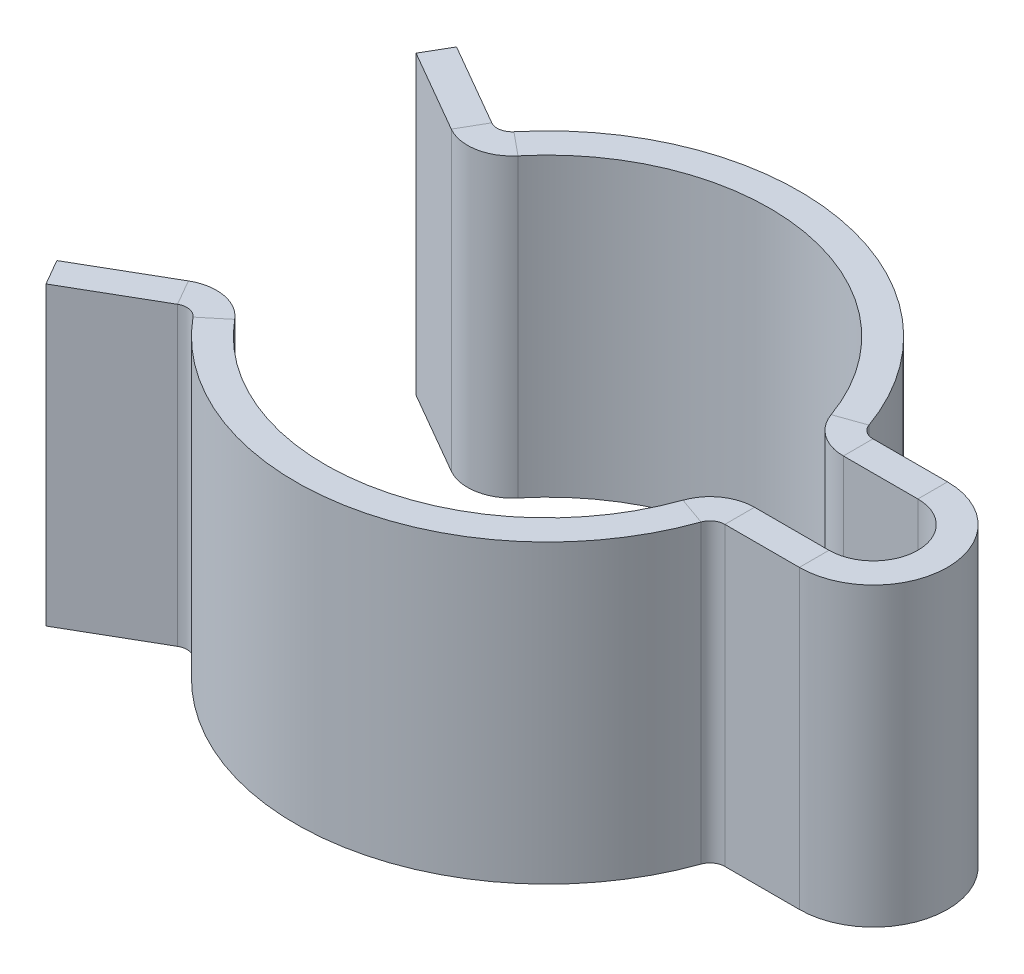
ISO-10303-21;
HEADER;
FILE_DESCRIPTION(('STEP AP214'),'2;1');
FILE_NAME('part.step','',(''),(''),'','','');
FILE_SCHEMA(('AUTOMOTIVE_DESIGN { 1 0 10303 214 1 1 1 1 }'));
ENDSEC;
DATA;
#1=APPLICATION_CONTEXT('core data for automotive mechanical design processes');
#2=APPLICATION_PROTOCOL_DEFINITION('international standard','automotive_design',2000,#1);
#3=PRODUCT_CONTEXT('',#1,'mechanical');
#4=PRODUCT('Part','Part','',(#3));
#5=PRODUCT_RELATED_PRODUCT_CATEGORY('part','',(#4));
#6=PRODUCT_DEFINITION_FORMATION('','',#4);
#7=PRODUCT_DEFINITION_CONTEXT('part definition',#1,'design');
#8=PRODUCT_DEFINITION('design','',#6,#7);
#9=PRODUCT_DEFINITION_SHAPE('','',#8);
#10=(LENGTH_UNIT() NAMED_UNIT(*) SI_UNIT(.MILLI.,.METRE.));
#11=(NAMED_UNIT(*) PLANE_ANGLE_UNIT() SI_UNIT($,.RADIAN.));
#12=(NAMED_UNIT(*) SI_UNIT($,.STERADIAN.) SOLID_ANGLE_UNIT());
#13=UNCERTAINTY_MEASURE_WITH_UNIT(LENGTH_MEASURE(1.E-05),#10,'distance_accuracy_value','');
#14=(GEOMETRIC_REPRESENTATION_CONTEXT(3) GLOBAL_UNCERTAINTY_ASSIGNED_CONTEXT((#13)) GLOBAL_UNIT_ASSIGNED_CONTEXT((#10,
#11,#12)) REPRESENTATION_CONTEXT('',''));
#15=CARTESIAN_POINT('',(0.,0.,0.));
#16=DIRECTION('',(0.,0.,1.));
#17=DIRECTION('',(1.,0.,0.));
#18=AXIS2_PLACEMENT_3D('',#15,#16,#17);
#19=CARTESIAN_POINT('',(1.1,1.,-0.15));
#20=DIRECTION('',(0.,1.,0.));
#21=DIRECTION('',(0.,0.,1.));
#22=AXIS2_PLACEMENT_3D('',#19,#20,#21);
#23=PLANE('',#22);
#24=DIRECTION('',(0.,0.,-1.));
#25=VECTOR('',#24,1.);
#26=CARTESIAN_POINT('',(1.1,1.,-0.15));
#27=LINE('',#26,#25);
#28=CARTESIAN_POINT('',(1.1,1.,-0.15));
#29=VERTEX_POINT('',#28);
#30=CARTESIAN_POINT('',(1.1,1.,-0.25));
#31=VERTEX_POINT('',#30);
#32=EDGE_CURVE('E13',#29,#31,#27,.T.);
#33=ORIENTED_EDGE('',*,*,#32,.F.);
#34=CARTESIAN_POINT('',(1.1,1.,0.));
#35=DIRECTION('',(0.,1.,0.));
#36=DIRECTION('',(0.,0.,1.));
#37=AXIS2_PLACEMENT_3D('',#34,#35,#36);
#38=CIRCLE('',#37,0.15);
#39=CARTESIAN_POINT('',(1.1,1.,0.15));
#40=VERTEX_POINT('',#39);
#41=EDGE_CURVE('E432',#40,#29,#38,.T.);
#42=ORIENTED_EDGE('',*,*,#41,.F.);
#43=DIRECTION('',(0.,0.,-1.));
#44=VECTOR('',#43,1.);
#45=CARTESIAN_POINT('',(1.1,1.,0.25));
#46=LINE('',#45,#44);
#47=CARTESIAN_POINT('',(1.1,1.,0.25));
#48=VERTEX_POINT('',#47);
#49=EDGE_CURVE('E56',#48,#40,#46,.T.);
#50=ORIENTED_EDGE('',*,*,#49,.F.);
#51=CARTESIAN_POINT('',(1.1,1.,0.));
#52=DIRECTION('',(0.,1.,0.));
#53=DIRECTION('',(1.,0.,0.));
#54=AXIS2_PLACEMENT_3D('',#51,#52,#53);
#55=CIRCLE('',#54,0.25);
#56=EDGE_CURVE('E470',#48,#31,#55,.T.);
#57=ORIENTED_EDGE('',*,*,#56,.T.);
#58=EDGE_LOOP('',(#33,#42,#50,#57));
#59=FACE_BOUND('',#58,.T.);
#60=ADVANCED_FACE('F48',(#59),#23,.T.);
#61=CARTESIAN_POINT('',(1.1,1.,0.25));
#62=DIRECTION('',(0.,1.,0.));
#63=DIRECTION('',(0.,0.,1.));
#64=AXIS2_PLACEMENT_3D('',#61,#62,#63);
#65=PLANE('',#64);
#66=DIRECTION('',(-1.,0.,0.));
#67=VECTOR('',#66,1.);
#68=CARTESIAN_POINT('',(1.1,1.,-0.15));
#69=LINE('',#68,#67);
#70=CARTESIAN_POINT('',(0.848528137423857,1.,-0.15));
#71=VERTEX_POINT('',#70);
#72=EDGE_CURVE('E436',#29,#71,#69,.T.);
#73=ORIENTED_EDGE('',*,*,#72,.F.);
#74=ORIENTED_EDGE('',*,*,#32,.T.);
#75=DIRECTION('',(-1.,0.,0.));
#76=VECTOR('',#75,1.);
#77=CARTESIAN_POINT('',(1.1,1.,-0.25));
#78=LINE('',#77,#76);
#79=CARTESIAN_POINT('',(0.848528137423857,1.,-0.25));
#80=VERTEX_POINT('',#79);
#81=EDGE_CURVE('E239',#31,#80,#78,.T.);
#82=ORIENTED_EDGE('',*,*,#81,.T.);
#83=DIRECTION('',(0.,0.,1.));
#84=VECTOR('',#83,1.);
#85=CARTESIAN_POINT('',(0.848528137423857,1.,-0.25));
#86=LINE('',#85,#84);
#87=EDGE_CURVE('E230',#80,#71,#86,.T.);
#88=ORIENTED_EDGE('',*,*,#87,.T.);
#89=EDGE_LOOP('',(#73,#74,#82,#88));
#90=FACE_BOUND('',#89,.T.);
#91=ADVANCED_FACE('F475',(#90),#65,.T.);
#92=CARTESIAN_POINT('',(1.1,0.,0.15));
#93=DIRECTION('',(0.,-1.,0.));
#94=DIRECTION('',(0.,0.,-1.));
#95=AXIS2_PLACEMENT_3D('',#92,#93,#94);
#96=PLANE('',#95);
#97=DIRECTION('',(0.,0.,1.));
#98=VECTOR('',#97,1.);
#99=CARTESIAN_POINT('',(1.1,0.,0.15));
#100=LINE('',#99,#98);
#101=CARTESIAN_POINT('',(1.1,0.,0.15));
#102=VERTEX_POINT('',#101);
#103=CARTESIAN_POINT('',(1.1,0.,0.25));
#104=VERTEX_POINT('',#103);
#105=EDGE_CURVE('E413',#102,#104,#100,.T.);
#106=ORIENTED_EDGE('',*,*,#105,.F.);
#107=CARTESIAN_POINT('',(1.1,0.,0.));
#108=DIRECTION('',(0.,1.,0.));
#109=DIRECTION('',(0.,0.,1.));
#110=AXIS2_PLACEMENT_3D('',#107,#108,#109);
#111=CIRCLE('',#110,0.15);
#112=CARTESIAN_POINT('',(1.1,0.,-0.15));
#113=VERTEX_POINT('',#112);
#114=EDGE_CURVE('E279',#102,#113,#111,.T.);
#115=ORIENTED_EDGE('',*,*,#114,.T.);
#116=DIRECTION('',(0.,0.,1.));
#117=VECTOR('',#116,1.);
#118=CARTESIAN_POINT('',(1.1,0.,-0.25));
#119=LINE('',#118,#117);
#120=CARTESIAN_POINT('',(1.1,0.,-0.25));
#121=VERTEX_POINT('',#120);
#122=EDGE_CURVE('E411',#121,#113,#119,.T.);
#123=ORIENTED_EDGE('',*,*,#122,.F.);
#124=CARTESIAN_POINT('',(1.1,0.,0.));
#125=DIRECTION('',(0.,1.,0.));
#126=DIRECTION('',(1.,0.,0.));
#127=AXIS2_PLACEMENT_3D('',#124,#125,#126);
#128=CIRCLE('',#127,0.25);
#129=EDGE_CURVE('E315',#104,#121,#128,.T.);
#130=ORIENTED_EDGE('',*,*,#129,.F.);
#131=EDGE_LOOP('',(#106,#115,#123,#130));
#132=FACE_BOUND('',#131,.T.);
#133=ADVANCED_FACE('F527',(#132),#96,.T.);
#134=CARTESIAN_POINT('',(1.1,0.,-0.25));
#135=DIRECTION('',(0.,-1.,0.));
#136=DIRECTION('',(0.,0.,-1.));
#137=AXIS2_PLACEMENT_3D('',#134,#135,#136);
#138=PLANE('',#137);
#139=DIRECTION('',(1.,0.,0.));
#140=VECTOR('',#139,1.);
#141=CARTESIAN_POINT('',(1.1,0.,0.15));
#142=LINE('',#141,#140);
#143=CARTESIAN_POINT('',(0.848528137423857,0.,0.15));
#144=VERTEX_POINT('',#143);
#145=EDGE_CURVE('E282',#144,#102,#142,.T.);
#146=ORIENTED_EDGE('',*,*,#145,.T.);
#147=ORIENTED_EDGE('',*,*,#105,.T.);
#148=DIRECTION('',(1.,0.,0.));
#149=VECTOR('',#148,1.);
#150=CARTESIAN_POINT('',(1.1,0.,0.25));
#151=LINE('',#150,#149);
#152=CARTESIAN_POINT('',(0.848528137423857,0.,0.25));
#153=VERTEX_POINT('',#152);
#154=EDGE_CURVE('E312',#153,#104,#151,.T.);
#155=ORIENTED_EDGE('',*,*,#154,.F.);
#156=DIRECTION('',(0.,0.,-1.));
#157=VECTOR('',#156,1.);
#158=CARTESIAN_POINT('',(0.848528137423857,0.,0.25));
#159=LINE('',#158,#157);
#160=EDGE_CURVE('E229',#153,#144,#159,.T.);
#161=ORIENTED_EDGE('',*,*,#160,.T.);
#162=EDGE_LOOP('',(#146,#147,#155,#161));
#163=FACE_BOUND('',#162,.T.);
#164=ADVANCED_FACE('F531',(#163),#138,.T.);
#165=CARTESIAN_POINT('',(-0.577934422872474,1.,0.478008161916782));
#166=DIRECTION('',(0.,1.,0.));
#167=DIRECTION('',(0.,0.,1.));
#168=AXIS2_PLACEMENT_3D('',#165,#166,#167);
#169=PLANE('',#168);
#170=DIRECTION('',(-0.770579230496633,0.,0.637344215889041));
#171=VECTOR('',#170,1.);
#172=CARTESIAN_POINT('',(-0.577934422872474,1.,0.478008161916782));
#173=LINE('',#172,#171);
#174=CARTESIAN_POINT('',(-0.577934422872474,1.,0.478008161916782));
#175=VERTEX_POINT('',#174);
#176=CARTESIAN_POINT('',(-0.654992345922137,1.,0.541742583505686));
#177=VERTEX_POINT('',#176);
#178=EDGE_CURVE('E409',#175,#177,#173,.T.);
#179=ORIENTED_EDGE('',*,*,#178,.F.);
#180=CARTESIAN_POINT('',(-0.693521307446968,1.,0.573609794300139));
#181=DIRECTION('',(0.,1.,0.));
#182=DIRECTION('',(0.,0.,1.));
#183=AXIS2_PLACEMENT_3D('',#180,#181,#182);
#184=CIRCLE('',#183,0.15);
#185=CARTESIAN_POINT('',(-0.768521307446969,1.,0.443705983732473));
#186=VERTEX_POINT('',#185);
#187=EDGE_CURVE('E448',#186,#175,#184,.F.);
#188=ORIENTED_EDGE('',*,*,#187,.F.);
#189=DIRECTION('',(-0.500000000000002,0.,-0.866025403784437));
#190=VECTOR('',#189,1.);
#191=CARTESIAN_POINT('',(-0.718521307446968,1.,0.530308524110917));
#192=LINE('',#191,#190);
#193=CARTESIAN_POINT('',(-0.718521307446968,1.,0.530308524110917));
#194=VERTEX_POINT('',#193);
#195=EDGE_CURVE('E407',#194,#186,#192,.T.);
#196=ORIENTED_EDGE('',*,*,#195,.F.);
#197=CARTESIAN_POINT('',(-0.693521307446968,1.,0.573609794300139));
#198=DIRECTION('',(0.,1.,0.));
#199=DIRECTION('',(1.,0.,0.));
#200=AXIS2_PLACEMENT_3D('',#197,#198,#199);
#201=CIRCLE('',#200,0.05);
#202=EDGE_CURVE('E460',#194,#177,#201,.F.);
#203=ORIENTED_EDGE('',*,*,#202,.T.);
#204=EDGE_LOOP('',(#179,#188,#196,#203));
#205=FACE_BOUND('',#204,.T.);
#206=ADVANCED_FACE('F562',(#205),#169,.T.);
#207=CARTESIAN_POINT('',(-0.718521307446968,1.,0.530308524110917));
#208=DIRECTION('',(0.,1.,0.));
#209=DIRECTION('',(0.,0.,1.));
#210=AXIS2_PLACEMENT_3D('',#207,#208,#209);
#211=PLANE('',#210);
#212=CARTESIAN_POINT('',(0.,1.,0.));
#213=DIRECTION('',(0.,1.,0.));
#214=DIRECTION('',(0.,0.,1.));
#215=AXIS2_PLACEMENT_3D('',#212,#213,#214);
#216=CIRCLE('',#215,0.75);
#217=CARTESIAN_POINT('',(0.707106781186547,1.,0.25));
#218=VERTEX_POINT('',#217);
#219=EDGE_CURVE('E442',#175,#218,#216,.T.);
#220=ORIENTED_EDGE('',*,*,#219,.F.);
#221=ORIENTED_EDGE('',*,*,#178,.T.);
#222=CARTESIAN_POINT('',(0.,1.,0.));
#223=DIRECTION('',(0.,1.,0.));
#224=DIRECTION('',(1.,0.,0.));
#225=AXIS2_PLACEMENT_3D('',#222,#223,#224);
#226=CIRCLE('',#225,0.85);
#227=CARTESIAN_POINT('',(0.801387685344754,1.,0.283333333333333));
#228=VERTEX_POINT('',#227);
#229=EDGE_CURVE('E463',#177,#228,#226,.T.);
#230=ORIENTED_EDGE('',*,*,#229,.T.);
#231=DIRECTION('',(-0.942809041582063,0.,-0.333333333333333));
#232=VECTOR('',#231,1.);
#233=CARTESIAN_POINT('',(0.801387685344754,1.,0.283333333333333));
#234=LINE('',#233,#232);
#235=EDGE_CURVE('E399',#228,#218,#234,.T.);
#236=ORIENTED_EDGE('',*,*,#235,.T.);
#237=EDGE_LOOP('',(#220,#221,#230,#236));
#238=FACE_BOUND('',#237,.T.);
#239=ADVANCED_FACE('F565',(#238),#211,.T.);
#240=CARTESIAN_POINT('',(-0.768521307446969,0.,0.443705983732473));
#241=DIRECTION('',(0.,-1.,0.));
#242=DIRECTION('',(0.,0.,-1.));
#243=AXIS2_PLACEMENT_3D('',#240,#241,#242);
#244=PLANE('',#243);
#245=DIRECTION('',(0.500000000000002,0.,0.866025403784437));
#246=VECTOR('',#245,1.);
#247=CARTESIAN_POINT('',(-0.768521307446969,0.,0.443705983732473));
#248=LINE('',#247,#246);
#249=CARTESIAN_POINT('',(-0.768521307446969,0.,0.443705983732473));
#250=VERTEX_POINT('',#249);
#251=CARTESIAN_POINT('',(-0.718521307446968,0.,0.530308524110917));
#252=VERTEX_POINT('',#251);
#253=EDGE_CURVE('E405',#250,#252,#248,.T.);
#254=ORIENTED_EDGE('',*,*,#253,.F.);
#255=CARTESIAN_POINT('',(-0.693521307446968,0.,0.573609794300139));
#256=DIRECTION('',(0.,1.,0.));
#257=DIRECTION('',(0.,0.,1.));
#258=AXIS2_PLACEMENT_3D('',#255,#256,#257);
#259=CIRCLE('',#258,0.15);
#260=CARTESIAN_POINT('',(-0.577934422872474,0.,0.478008161916782));
#261=VERTEX_POINT('',#260);
#262=EDGE_CURVE('E291',#250,#261,#259,.F.);
#263=ORIENTED_EDGE('',*,*,#262,.T.);
#264=DIRECTION('',(0.770579230496633,0.,-0.637344215889041));
#265=VECTOR('',#264,1.);
#266=CARTESIAN_POINT('',(-0.654992345922137,0.,0.541742583505686));
#267=LINE('',#266,#265);
#268=CARTESIAN_POINT('',(-0.654992345922137,0.,0.541742583505686));
#269=VERTEX_POINT('',#268);
#270=EDGE_CURVE('E403',#269,#261,#267,.T.);
#271=ORIENTED_EDGE('',*,*,#270,.F.);
#272=CARTESIAN_POINT('',(-0.693521307446968,0.,0.573609794300139));
#273=DIRECTION('',(0.,1.,0.));
#274=DIRECTION('',(1.,0.,0.));
#275=AXIS2_PLACEMENT_3D('',#272,#273,#274);
#276=CIRCLE('',#275,0.05);
#277=EDGE_CURVE('E303',#252,#269,#276,.F.);
#278=ORIENTED_EDGE('',*,*,#277,.F.);
#279=EDGE_LOOP('',(#254,#263,#271,#278));
#280=FACE_BOUND('',#279,.T.);
#281=ADVANCED_FACE('F569',(#280),#244,.T.);
#282=CARTESIAN_POINT('',(-0.654992345922137,0.,0.541742583505686));
#283=DIRECTION('',(0.,-1.,0.));
#284=DIRECTION('',(0.,0.,-1.));
#285=AXIS2_PLACEMENT_3D('',#282,#283,#284);
#286=PLANE('',#285);
#287=DIRECTION('',(0.866025403784437,0.,-0.500000000000002));
#288=VECTOR('',#287,1.);
#289=CARTESIAN_POINT('',(-0.649519052838328,0.,0.375000000000002));
#290=LINE('',#289,#288);
#291=CARTESIAN_POINT('',(-1.05,0.,0.60621778264911));
#292=VERTEX_POINT('',#291);
#293=EDGE_CURVE('E294',#292,#250,#290,.T.);
#294=ORIENTED_EDGE('',*,*,#293,.T.);
#295=ORIENTED_EDGE('',*,*,#253,.T.);
#296=DIRECTION('',(0.866025403784437,0.,-0.500000000000002));
#297=VECTOR('',#296,1.);
#298=CARTESIAN_POINT('',(-0.599519052838328,0.,0.461602540378446));
#299=LINE('',#298,#297);
#300=CARTESIAN_POINT('',(-0.999999999999999,0.,0.692820323027554));
#301=VERTEX_POINT('',#300);
#302=EDGE_CURVE('E300',#301,#252,#299,.T.);
#303=ORIENTED_EDGE('',*,*,#302,.F.);
#304=DIRECTION('',(-0.500000000000003,0.,-0.866025403784437));
#305=VECTOR('',#304,1.);
#306=CARTESIAN_POINT('',(-0.999999999999999,0.,0.692820323027554));
#307=LINE('',#306,#305);
#308=EDGE_CURVE('E297',#301,#292,#307,.T.);
#309=ORIENTED_EDGE('',*,*,#308,.T.);
#310=EDGE_LOOP('',(#294,#295,#303,#309));
#311=FACE_BOUND('',#310,.T.);
#312=ADVANCED_FACE('F573',(#311),#286,.T.);
#313=CARTESIAN_POINT('',(0.848528137423857,1.,0.15));
#314=DIRECTION('',(0.,1.,0.));
#315=DIRECTION('',(0.,0.,1.));
#316=AXIS2_PLACEMENT_3D('',#313,#314,#315);
#317=PLANE('',#316);
#318=DIRECTION('',(0.,0.,1.));
#319=VECTOR('',#318,1.);
#320=CARTESIAN_POINT('',(0.848528137423857,1.,0.15));
#321=LINE('',#320,#319);
#322=CARTESIAN_POINT('',(0.848528137423857,1.,0.15));
#323=VERTEX_POINT('',#322);
#324=CARTESIAN_POINT('',(0.848528137423857,1.,0.25));
#325=VERTEX_POINT('',#324);
#326=EDGE_CURVE('E401',#323,#325,#321,.T.);
#327=ORIENTED_EDGE('',*,*,#326,.F.);
#328=CARTESIAN_POINT('',(0.848528137423857,1.,0.3));
#329=DIRECTION('',(0.,1.,0.));
#330=DIRECTION('',(0.,0.,1.));
#331=AXIS2_PLACEMENT_3D('',#328,#329,#330);
#332=CIRCLE('',#331,0.15);
#333=EDGE_CURVE('E440',#218,#323,#332,.F.);
#334=ORIENTED_EDGE('',*,*,#333,.F.);
#335=ORIENTED_EDGE('',*,*,#235,.F.);
#336=CARTESIAN_POINT('',(0.848528137423857,1.,0.3));
#337=DIRECTION('',(0.,1.,0.));
#338=DIRECTION('',(1.,0.,0.));
#339=AXIS2_PLACEMENT_3D('',#336,#337,#338);
#340=CIRCLE('',#339,0.05);
#341=EDGE_CURVE('E466',#228,#325,#340,.F.);
#342=ORIENTED_EDGE('',*,*,#341,.T.);
#343=EDGE_LOOP('',(#327,#334,#335,#342));
#344=FACE_BOUND('',#343,.T.);
#345=ADVANCED_FACE('F577',(#344),#317,.T.);
#346=CARTESIAN_POINT('',(0.801387685344754,1.,0.283333333333333));
#347=DIRECTION('',(0.,1.,0.));
#348=DIRECTION('',(0.,0.,1.));
#349=AXIS2_PLACEMENT_3D('',#346,#347,#348);
#350=PLANE('',#349);
#351=DIRECTION('',(1.,0.,0.));
#352=VECTOR('',#351,1.);
#353=CARTESIAN_POINT('',(1.1,1.,0.15));
#354=LINE('',#353,#352);
#355=EDGE_CURVE('E420',#323,#40,#354,.T.);
#356=ORIENTED_EDGE('',*,*,#355,.F.);
#357=ORIENTED_EDGE('',*,*,#326,.T.);
#358=DIRECTION('',(1.,0.,0.));
#359=VECTOR('',#358,1.);
#360=CARTESIAN_POINT('',(1.1,1.,0.25));
#361=LINE('',#360,#359);
#362=EDGE_CURVE('E423',#325,#48,#361,.T.);
#363=ORIENTED_EDGE('',*,*,#362,.T.);
#364=ORIENTED_EDGE('',*,*,#49,.T.);
#365=EDGE_LOOP('',(#356,#357,#363,#364));
#366=FACE_BOUND('',#365,.T.);
#367=ADVANCED_FACE('F418',(#366),#350,.T.);
#368=CARTESIAN_POINT('',(0.707106781186547,0.,0.25));
#369=DIRECTION('',(0.,-1.,0.));
#370=DIRECTION('',(0.,0.,-1.));
#371=AXIS2_PLACEMENT_3D('',#368,#369,#370);
#372=PLANE('',#371);
#373=DIRECTION('',(0.942809041582063,0.,0.333333333333333));
#374=VECTOR('',#373,1.);
#375=CARTESIAN_POINT('',(0.707106781186547,0.,0.25));
#376=LINE('',#375,#374);
#377=CARTESIAN_POINT('',(0.707106781186547,0.,0.25));
#378=VERTEX_POINT('',#377);
#379=CARTESIAN_POINT('',(0.801387685344754,0.,0.283333333333333));
#380=VERTEX_POINT('',#379);
#381=EDGE_CURVE('E397',#378,#380,#376,.T.);
#382=ORIENTED_EDGE('',*,*,#381,.F.);
#383=CARTESIAN_POINT('',(0.848528137423857,0.,0.3));
#384=DIRECTION('',(0.,1.,0.));
#385=DIRECTION('',(0.,0.,1.));
#386=AXIS2_PLACEMENT_3D('',#383,#384,#385);
#387=CIRCLE('',#386,0.15);
#388=EDGE_CURVE('E285',#378,#144,#387,.F.);
#389=ORIENTED_EDGE('',*,*,#388,.T.);
#390=ORIENTED_EDGE('',*,*,#160,.F.);
#391=CARTESIAN_POINT('',(0.848528137423857,0.,0.3));
#392=DIRECTION('',(0.,1.,0.));
#393=DIRECTION('',(1.,0.,0.));
#394=AXIS2_PLACEMENT_3D('',#391,#392,#393);
#395=CIRCLE('',#394,0.05);
#396=EDGE_CURVE('E309',#380,#153,#395,.F.);
#397=ORIENTED_EDGE('',*,*,#396,.F.);
#398=EDGE_LOOP('',(#382,#389,#390,#397));
#399=FACE_BOUND('',#398,.T.);
#400=ADVANCED_FACE('F584',(#399),#372,.T.);
#401=CARTESIAN_POINT('',(0.848528137423857,0.,0.25));
#402=DIRECTION('',(0.,-1.,0.));
#403=DIRECTION('',(0.,0.,-1.));
#404=AXIS2_PLACEMENT_3D('',#401,#402,#403);
#405=PLANE('',#404);
#406=CARTESIAN_POINT('',(0.,0.,0.));
#407=DIRECTION('',(0.,1.,0.));
#408=DIRECTION('',(0.,0.,1.));
#409=AXIS2_PLACEMENT_3D('',#406,#407,#408);
#410=CIRCLE('',#409,0.75);
#411=EDGE_CURVE('E288',#261,#378,#410,.T.);
#412=ORIENTED_EDGE('',*,*,#411,.T.);
#413=ORIENTED_EDGE('',*,*,#381,.T.);
#414=CARTESIAN_POINT('',(0.,0.,0.));
#415=DIRECTION('',(0.,1.,0.));
#416=DIRECTION('',(1.,0.,0.));
#417=AXIS2_PLACEMENT_3D('',#414,#415,#416);
#418=CIRCLE('',#417,0.85);
#419=EDGE_CURVE('E306',#269,#380,#418,.T.);
#420=ORIENTED_EDGE('',*,*,#419,.F.);
#421=ORIENTED_EDGE('',*,*,#270,.T.);
#422=EDGE_LOOP('',(#412,#413,#420,#421));
#423=FACE_BOUND('',#422,.T.);
#424=ADVANCED_FACE('F587',(#423),#405,.T.);
#425=CARTESIAN_POINT('',(0.707106781186547,1.,-0.25));
#426=DIRECTION('',(0.,1.,0.));
#427=DIRECTION('',(0.,0.,1.));
#428=AXIS2_PLACEMENT_3D('',#425,#426,#427);
#429=PLANE('',#428);
#430=DIRECTION('',(0.942809041582063,0.,-0.333333333333333));
#431=VECTOR('',#430,1.);
#432=CARTESIAN_POINT('',(0.707106781186547,1.,-0.25));
#433=LINE('',#432,#431);
#434=CARTESIAN_POINT('',(0.707106781186547,1.,-0.25));
#435=VERTEX_POINT('',#434);
#436=CARTESIAN_POINT('',(0.801387685344754,1.,-0.283333333333333));
#437=VERTEX_POINT('',#436);
#438=EDGE_CURVE('E217',#435,#437,#433,.T.);
#439=ORIENTED_EDGE('',*,*,#438,.F.);
#440=CARTESIAN_POINT('',(0.848528137423857,1.,-0.3));
#441=DIRECTION('',(0.,1.,0.));
#442=DIRECTION('',(0.,0.,1.));
#443=AXIS2_PLACEMENT_3D('',#440,#441,#442);
#444=CIRCLE('',#443,0.15);
#445=EDGE_CURVE('E487',#71,#435,#444,.F.);
#446=ORIENTED_EDGE('',*,*,#445,.F.);
#447=ORIENTED_EDGE('',*,*,#87,.F.);
#448=CARTESIAN_POINT('',(0.848528137423857,1.,-0.3));
#449=DIRECTION('',(0.,1.,0.));
#450=DIRECTION('',(1.,0.,0.));
#451=AXIS2_PLACEMENT_3D('',#448,#449,#450);
#452=CIRCLE('',#451,0.05);
#453=EDGE_CURVE('E233',#80,#437,#452,.F.);
#454=ORIENTED_EDGE('',*,*,#453,.T.);
#455=EDGE_LOOP('',(#439,#446,#447,#454));
#456=FACE_BOUND('',#455,.T.);
#457=ADVANCED_FACE('F235',(#456),#429,.T.);
#458=CARTESIAN_POINT('',(0.848528137423857,1.,-0.25));
#459=DIRECTION('',(0.,1.,0.));
#460=DIRECTION('',(0.,0.,1.));
#461=AXIS2_PLACEMENT_3D('',#458,#459,#460);
#462=PLANE('',#461);
#463=CARTESIAN_POINT('',(0.,1.,0.));
#464=DIRECTION('',(0.,1.,0.));
#465=DIRECTION('',(0.,0.,1.));
#466=AXIS2_PLACEMENT_3D('',#463,#464,#465);
#467=CIRCLE('',#466,0.75);
#468=CARTESIAN_POINT('',(-0.577934422872474,1.,-0.478008161916782));
#469=VERTEX_POINT('',#468);
#470=EDGE_CURVE('E224',#435,#469,#467,.T.);
#471=ORIENTED_EDGE('',*,*,#470,.F.);
#472=ORIENTED_EDGE('',*,*,#438,.T.);
#473=CARTESIAN_POINT('',(0.,1.,0.));
#474=DIRECTION('',(0.,1.,0.));
#475=DIRECTION('',(1.,0.,0.));
#476=AXIS2_PLACEMENT_3D('',#473,#474,#475);
#477=CIRCLE('',#476,0.85);
#478=CARTESIAN_POINT('',(-0.654992345922138,1.,-0.541742583505686));
#479=VERTEX_POINT('',#478);
#480=EDGE_CURVE('E221',#437,#479,#477,.T.);
#481=ORIENTED_EDGE('',*,*,#480,.T.);
#482=DIRECTION('',(0.770579230496633,0.,0.637344215889041));
#483=VECTOR('',#482,1.);
#484=CARTESIAN_POINT('',(-0.654992345922138,1.,-0.541742583505686));
#485=LINE('',#484,#483);
#486=EDGE_CURVE('E388',#479,#469,#485,.T.);
#487=ORIENTED_EDGE('',*,*,#486,.T.);
#488=EDGE_LOOP('',(#471,#472,#481,#487));
#489=FACE_BOUND('',#488,.T.);
#490=ADVANCED_FACE('F219',(#489),#462,.T.);
#491=CARTESIAN_POINT('',(0.848528137423857,0.,-0.15));
#492=DIRECTION('',(0.,-1.,0.));
#493=DIRECTION('',(0.,0.,-1.));
#494=AXIS2_PLACEMENT_3D('',#491,#492,#493);
#495=PLANE('',#494);
#496=DIRECTION('',(0.,0.,-1.));
#497=VECTOR('',#496,1.);
#498=CARTESIAN_POINT('',(0.848528137423857,0.,-0.15));
#499=LINE('',#498,#497);
#500=CARTESIAN_POINT('',(0.848528137423857,0.,-0.15));
#501=VERTEX_POINT('',#500);
#502=CARTESIAN_POINT('',(0.848528137423857,0.,-0.25));
#503=VERTEX_POINT('',#502);
#504=EDGE_CURVE('E393',#501,#503,#499,.T.);
#505=ORIENTED_EDGE('',*,*,#504,.F.);
#506=CARTESIAN_POINT('',(0.848528137423857,0.,-0.3));
#507=DIRECTION('',(0.,1.,0.));
#508=DIRECTION('',(0.,0.,1.));
#509=AXIS2_PLACEMENT_3D('',#506,#507,#508);
#510=CIRCLE('',#509,0.15);
#511=CARTESIAN_POINT('',(0.707106781186547,0.,-0.25));
#512=VERTEX_POINT('',#511);
#513=EDGE_CURVE('E273',#501,#512,#510,.F.);
#514=ORIENTED_EDGE('',*,*,#513,.T.);
#515=DIRECTION('',(-0.942809041582063,0.,0.333333333333333));
#516=VECTOR('',#515,1.);
#517=CARTESIAN_POINT('',(0.801387685344754,0.,-0.283333333333333));
#518=LINE('',#517,#516);
#519=CARTESIAN_POINT('',(0.801387685344754,0.,-0.283333333333333));
#520=VERTEX_POINT('',#519);
#521=EDGE_CURVE('E391',#520,#512,#518,.T.);
#522=ORIENTED_EDGE('',*,*,#521,.F.);
#523=CARTESIAN_POINT('',(0.848528137423857,0.,-0.3));
#524=DIRECTION('',(0.,1.,0.));
#525=DIRECTION('',(1.,0.,0.));
#526=AXIS2_PLACEMENT_3D('',#523,#524,#525);
#527=CIRCLE('',#526,0.05);
#528=EDGE_CURVE('E246',#503,#520,#527,.F.);
#529=ORIENTED_EDGE('',*,*,#528,.F.);
#530=EDGE_LOOP('',(#505,#514,#522,#529));
#531=FACE_BOUND('',#530,.T.);
#532=ADVANCED_FACE('F481',(#531),#495,.T.);
#533=CARTESIAN_POINT('',(0.801387685344754,0.,-0.283333333333333));
#534=DIRECTION('',(0.,-1.,0.));
#535=DIRECTION('',(0.,0.,-1.));
#536=AXIS2_PLACEMENT_3D('',#533,#534,#535);
#537=PLANE('',#536);
#538=DIRECTION('',(-1.,0.,0.));
#539=VECTOR('',#538,1.);
#540=CARTESIAN_POINT('',(1.1,0.,-0.15));
#541=LINE('',#540,#539);
#542=EDGE_CURVE('E276',#113,#501,#541,.T.);
#543=ORIENTED_EDGE('',*,*,#542,.T.);
#544=ORIENTED_EDGE('',*,*,#504,.T.);
#545=DIRECTION('',(-1.,0.,0.));
#546=VECTOR('',#545,1.);
#547=CARTESIAN_POINT('',(1.1,0.,-0.25));
#548=LINE('',#547,#546);
#549=EDGE_CURVE('E318',#121,#503,#548,.T.);
#550=ORIENTED_EDGE('',*,*,#549,.F.);
#551=ORIENTED_EDGE('',*,*,#122,.T.);
#552=EDGE_LOOP('',(#543,#544,#550,#551));
#553=FACE_BOUND('',#552,.T.);
#554=ADVANCED_FACE('F539',(#553),#537,.T.);
#555=CARTESIAN_POINT('',(-0.768521307446969,1.,-0.443705983732472));
#556=DIRECTION('',(0.,1.,0.));
#557=DIRECTION('',(0.,0.,1.));
#558=AXIS2_PLACEMENT_3D('',#555,#556,#557);
#559=PLANE('',#558);
#560=DIRECTION('',(0.500000000000001,0.,-0.866025403784438));
#561=VECTOR('',#560,1.);
#562=CARTESIAN_POINT('',(-0.768521307446969,1.,-0.443705983732472));
#563=LINE('',#562,#561);
#564=CARTESIAN_POINT('',(-0.768521307446969,1.,-0.443705983732472));
#565=VERTEX_POINT('',#564);
#566=CARTESIAN_POINT('',(-0.718521307446969,1.,-0.530308524110916));
#567=VERTEX_POINT('',#566);
#568=EDGE_CURVE('E64',#565,#567,#563,.T.);
#569=ORIENTED_EDGE('',*,*,#568,.F.);
#570=CARTESIAN_POINT('',(-0.693521307446969,1.,-0.573609794300138));
#571=DIRECTION('',(0.,1.,0.));
#572=DIRECTION('',(0.,0.,1.));
#573=AXIS2_PLACEMENT_3D('',#570,#571,#572);
#574=CIRCLE('',#573,0.15);
#575=EDGE_CURVE('E515',#469,#565,#574,.F.);
#576=ORIENTED_EDGE('',*,*,#575,.F.);
#577=ORIENTED_EDGE('',*,*,#486,.F.);
#578=CARTESIAN_POINT('',(-0.693521307446969,1.,-0.573609794300138));
#579=DIRECTION('',(0.,1.,0.));
#580=DIRECTION('',(1.,0.,0.));
#581=AXIS2_PLACEMENT_3D('',#578,#579,#580);
#582=CIRCLE('',#581,0.05);
#583=EDGE_CURVE('E254',#479,#567,#582,.F.);
#584=ORIENTED_EDGE('',*,*,#583,.T.);
#585=EDGE_LOOP('',(#569,#576,#577,#584));
#586=FACE_BOUND('',#585,.T.);
#587=ADVANCED_FACE('F541',(#586),#559,.T.);
#588=CARTESIAN_POINT('',(-0.654992345922138,1.,-0.541742583505686));
#589=DIRECTION('',(0.,1.,0.));
#590=DIRECTION('',(0.,0.,1.));
#591=AXIS2_PLACEMENT_3D('',#588,#589,#590);
#592=PLANE('',#591);
#593=DIRECTION('',(-0.866025403784438,0.,-0.500000000000001));
#594=VECTOR('',#593,1.);
#595=CARTESIAN_POINT('',(-0.649519052838328,1.,-0.375000000000001));
#596=LINE('',#595,#594);
#597=CARTESIAN_POINT('',(-1.05,1.,-0.606217782649109));
#598=VERTEX_POINT('',#597);
#599=EDGE_CURVE('E513',#565,#598,#596,.T.);
#600=ORIENTED_EDGE('',*,*,#599,.F.);
#601=ORIENTED_EDGE('',*,*,#568,.T.);
#602=DIRECTION('',(-0.866025403784438,0.,-0.500000000000001));
#603=VECTOR('',#602,1.);
#604=CARTESIAN_POINT('',(-0.599519052838328,1.,-0.461602540378445));
#605=LINE('',#604,#603);
#606=CARTESIAN_POINT('',(-1.,1.,-0.692820323027553));
#607=VERTEX_POINT('',#606);
#608=EDGE_CURVE('E154',#567,#607,#605,.T.);
#609=ORIENTED_EDGE('',*,*,#608,.T.);
#610=DIRECTION('',(0.500000000000001,0.,-0.866025403784438));
#611=VECTOR('',#610,1.);
#612=CARTESIAN_POINT('',(-1.05,1.,-0.606217782649109));
#613=LINE('',#612,#611);
#614=EDGE_CURVE('E511',#598,#607,#613,.T.);
#615=ORIENTED_EDGE('',*,*,#614,.F.);
#616=EDGE_LOOP('',(#600,#601,#609,#615));
#617=FACE_BOUND('',#616,.T.);
#618=ADVANCED_FACE('F547',(#617),#592,.T.);
#619=CARTESIAN_POINT('',(-0.577934422872474,0.,-0.478008161916782));
#620=DIRECTION('',(0.,-1.,0.));
#621=DIRECTION('',(0.,0.,-1.));
#622=AXIS2_PLACEMENT_3D('',#619,#620,#621);
#623=PLANE('',#622);
#624=DIRECTION('',(-0.770579230496633,0.,-0.637344215889041));
#625=VECTOR('',#624,1.);
#626=CARTESIAN_POINT('',(-0.577934422872474,0.,-0.478008161916782));
#627=LINE('',#626,#625);
#628=CARTESIAN_POINT('',(-0.577934422872474,0.,-0.478008161916782));
#629=VERTEX_POINT('',#628);
#630=CARTESIAN_POINT('',(-0.654992345922138,0.,-0.541742583505686));
#631=VERTEX_POINT('',#630);
#632=EDGE_CURVE('E141',#629,#631,#627,.T.);
#633=ORIENTED_EDGE('',*,*,#632,.F.);
#634=CARTESIAN_POINT('',(-0.693521307446969,0.,-0.573609794300138));
#635=DIRECTION('',(0.,1.,0.));
#636=DIRECTION('',(0.,0.,1.));
#637=AXIS2_PLACEMENT_3D('',#634,#635,#636);
#638=CIRCLE('',#637,0.15);
#639=CARTESIAN_POINT('',(-0.768521307446969,0.,-0.443705983732472));
#640=VERTEX_POINT('',#639);
#641=EDGE_CURVE('E269',#629,#640,#638,.F.);
#642=ORIENTED_EDGE('',*,*,#641,.T.);
#643=DIRECTION('',(-0.500000000000001,0.,0.866025403784438));
#644=VECTOR('',#643,1.);
#645=CARTESIAN_POINT('',(-0.718521307446969,0.,-0.530308524110916));
#646=LINE('',#645,#644);
#647=CARTESIAN_POINT('',(-0.718521307446969,0.,-0.530308524110916));
#648=VERTEX_POINT('',#647);
#649=EDGE_CURVE('E148',#648,#640,#646,.T.);
#650=ORIENTED_EDGE('',*,*,#649,.F.);
#651=CARTESIAN_POINT('',(-0.693521307446969,0.,-0.573609794300138));
#652=DIRECTION('',(0.,1.,0.));
#653=DIRECTION('',(1.,0.,0.));
#654=AXIS2_PLACEMENT_3D('',#651,#652,#653);
#655=CIRCLE('',#654,0.05);
#656=EDGE_CURVE('E324',#631,#648,#655,.F.);
#657=ORIENTED_EDGE('',*,*,#656,.F.);
#658=EDGE_LOOP('',(#633,#642,#650,#657));
#659=FACE_BOUND('',#658,.T.);
#660=ADVANCED_FACE('F498',(#659),#623,.T.);
#661=CARTESIAN_POINT('',(-0.718521307446969,0.,-0.530308524110916));
#662=DIRECTION('',(0.,-1.,0.));
#663=DIRECTION('',(0.,0.,-1.));
#664=AXIS2_PLACEMENT_3D('',#661,#662,#663);
#665=PLANE('',#664);
#666=CARTESIAN_POINT('',(0.,0.,0.));
#667=DIRECTION('',(0.,1.,0.));
#668=DIRECTION('',(0.,0.,1.));
#669=AXIS2_PLACEMENT_3D('',#666,#667,#668);
#670=CIRCLE('',#669,0.75);
#671=EDGE_CURVE('E271',#512,#629,#670,.T.);
#672=ORIENTED_EDGE('',*,*,#671,.T.);
#673=ORIENTED_EDGE('',*,*,#632,.T.);
#674=CARTESIAN_POINT('',(0.,0.,0.));
#675=DIRECTION('',(0.,1.,0.));
#676=DIRECTION('',(1.,0.,0.));
#677=AXIS2_PLACEMENT_3D('',#674,#675,#676);
#678=CIRCLE('',#677,0.85);
#679=EDGE_CURVE('E322',#520,#631,#678,.T.);
#680=ORIENTED_EDGE('',*,*,#679,.F.);
#681=ORIENTED_EDGE('',*,*,#521,.T.);
#682=EDGE_LOOP('',(#672,#673,#680,#681));
#683=FACE_BOUND('',#682,.T.);
#684=ADVANCED_FACE('F483',(#683),#665,.T.);
#685=CARTESIAN_POINT('',(-0.599519052838328,1.,-0.461602540378445));
#686=DIRECTION('',(-0.500000000000001,0.,0.866025403784438));
#687=DIRECTION('',(0.866025403784438,0.,0.500000000000001));
#688=AXIS2_PLACEMENT_3D('',#685,#686,#687);
#689=PLANE('',#688);
#690=DIRECTION('',(-0.866025403784438,0.,-0.500000000000001));
#691=VECTOR('',#690,1.);
#692=CARTESIAN_POINT('',(-0.599519052838328,0.,-0.461602540378445));
#693=LINE('',#692,#691);
#694=CARTESIAN_POINT('',(-1.,0.,-0.692820323027553));
#695=VERTEX_POINT('',#694);
#696=EDGE_CURVE('E260',#648,#695,#693,.T.);
#697=ORIENTED_EDGE('',*,*,#696,.T.);
#698=DIRECTION('',(0.,-1.,0.));
#699=VECTOR('',#698,1.);
#700=CARTESIAN_POINT('',(-1.,1.,-0.692820323027553));
#701=LINE('',#700,#699);
#702=EDGE_CURVE('E384',#607,#695,#701,.T.);
#703=ORIENTED_EDGE('',*,*,#702,.F.);
#704=ORIENTED_EDGE('',*,*,#608,.F.);
#705=DIRECTION('',(0.,-1.,0.));
#706=VECTOR('',#705,1.);
#707=CARTESIAN_POINT('',(-0.718521307446969,1.,-0.530308524110916));
#708=LINE('',#707,#706);
#709=EDGE_CURVE('E256',#567,#648,#708,.T.);
#710=ORIENTED_EDGE('',*,*,#709,.T.);
#711=EDGE_LOOP('',(#697,#703,#704,#710));
#712=FACE_BOUND('',#711,.T.);
#713=ADVANCED_FACE('F504',(#712),#689,.F.);
#714=CARTESIAN_POINT('',(-1.05,1.,-0.606217782649109));
#715=DIRECTION('',(-0.866025403784438,0.,-0.500000000000001));
#716=DIRECTION('',(-0.500000000000001,0.,0.866025403784438));
#717=AXIS2_PLACEMENT_3D('',#714,#715,#716);
#718=PLANE('',#717);
#719=DIRECTION('',(0.500000000000001,0.,-0.866025403784438));
#720=VECTOR('',#719,1.);
#721=CARTESIAN_POINT('',(-1.05,0.,-0.606217782649109));
#722=LINE('',#721,#720);
#723=CARTESIAN_POINT('',(-1.05,0.,-0.606217782649109));
#724=VERTEX_POINT('',#723);
#725=EDGE_CURVE('E263',#724,#695,#722,.T.);
#726=ORIENTED_EDGE('',*,*,#725,.F.);
#727=DIRECTION('',(0.,-1.,0.));
#728=VECTOR('',#727,1.);
#729=CARTESIAN_POINT('',(-1.05,1.,-0.606217782649109));
#730=LINE('',#729,#728);
#731=EDGE_CURVE('E382',#598,#724,#730,.T.);
#732=ORIENTED_EDGE('',*,*,#731,.F.);
#733=ORIENTED_EDGE('',*,*,#614,.T.);
#734=ORIENTED_EDGE('',*,*,#702,.T.);
#735=EDGE_LOOP('',(#726,#732,#733,#734));
#736=FACE_BOUND('',#735,.T.);
#737=ADVANCED_FACE('F509',(#736),#718,.T.);
#738=CARTESIAN_POINT('',(-0.649519052838328,1.,-0.375000000000001));
#739=DIRECTION('',(-0.500000000000001,0.,0.866025403784438));
#740=DIRECTION('',(0.866025403784438,0.,0.500000000000001));
#741=AXIS2_PLACEMENT_3D('',#738,#739,#740);
#742=PLANE('',#741);
#743=DIRECTION('',(-0.866025403784438,0.,-0.500000000000001));
#744=VECTOR('',#743,1.);
#745=CARTESIAN_POINT('',(-0.649519052838328,0.,-0.375000000000001));
#746=LINE('',#745,#744);
#747=EDGE_CURVE('E266',#640,#724,#746,.T.);
#748=ORIENTED_EDGE('',*,*,#747,.F.);
#749=DIRECTION('',(0.,-1.,0.));
#750=VECTOR('',#749,1.);
#751=CARTESIAN_POINT('',(-0.768521307446969,1.,-0.443705983732472));
#752=LINE('',#751,#750);
#753=EDGE_CURVE('E379',#565,#640,#752,.T.);
#754=ORIENTED_EDGE('',*,*,#753,.F.);
#755=ORIENTED_EDGE('',*,*,#599,.T.);
#756=ORIENTED_EDGE('',*,*,#731,.T.);
#757=EDGE_LOOP('',(#748,#754,#755,#756));
#758=FACE_BOUND('',#757,.T.);
#759=ADVANCED_FACE('F661',(#758),#742,.T.);
#760=CARTESIAN_POINT('',(-0.693521307446969,1.,-0.573609794300138));
#761=DIRECTION('',(0.,-1.,0.));
#762=DIRECTION('',(0.,0.,-1.));
#763=AXIS2_PLACEMENT_3D('',#760,#761,#762);
#764=CYLINDRICAL_SURFACE('',#763,0.15);
#765=ORIENTED_EDGE('',*,*,#641,.F.);
#766=DIRECTION('',(0.,-1.,0.));
#767=VECTOR('',#766,1.);
#768=CARTESIAN_POINT('',(-0.577934422872474,1.,-0.478008161916782));
#769=LINE('',#768,#767);
#770=EDGE_CURVE('E376',#469,#629,#769,.T.);
#771=ORIENTED_EDGE('',*,*,#770,.F.);
#772=ORIENTED_EDGE('',*,*,#575,.T.);
#773=ORIENTED_EDGE('',*,*,#753,.T.);
#774=EDGE_LOOP('',(#765,#771,#772,#773));
#775=FACE_BOUND('',#774,.T.);
#776=ADVANCED_FACE('F495',(#775),#764,.T.);
#777=CARTESIAN_POINT('',(0.,1.,0.));
#778=DIRECTION('',(0.,-1.,0.));
#779=DIRECTION('',(0.,0.,-1.));
#780=AXIS2_PLACEMENT_3D('',#777,#778,#779);
#781=CYLINDRICAL_SURFACE('',#780,0.75);
#782=ORIENTED_EDGE('',*,*,#671,.F.);
#783=DIRECTION('',(0.,-1.,0.));
#784=VECTOR('',#783,1.);
#785=CARTESIAN_POINT('',(0.707106781186547,1.,-0.25));
#786=LINE('',#785,#784);
#787=EDGE_CURVE('E373',#435,#512,#786,.T.);
#788=ORIENTED_EDGE('',*,*,#787,.F.);
#789=ORIENTED_EDGE('',*,*,#470,.T.);
#790=ORIENTED_EDGE('',*,*,#770,.T.);
#791=EDGE_LOOP('',(#782,#788,#789,#790));
#792=FACE_BOUND('',#791,.T.);
#793=ADVANCED_FACE('F489',(#792),#781,.F.);
#794=CARTESIAN_POINT('',(0.848528137423857,1.,-0.3));
#795=DIRECTION('',(0.,-1.,0.));
#796=DIRECTION('',(0.,0.,-1.));
#797=AXIS2_PLACEMENT_3D('',#794,#795,#796);
#798=CYLINDRICAL_SURFACE('',#797,0.15);
#799=ORIENTED_EDGE('',*,*,#513,.F.);
#800=DIRECTION('',(0.,-1.,0.));
#801=VECTOR('',#800,1.);
#802=CARTESIAN_POINT('',(0.848528137423857,1.,-0.15));
#803=LINE('',#802,#801);
#804=EDGE_CURVE('E370',#71,#501,#803,.T.);
#805=ORIENTED_EDGE('',*,*,#804,.F.);
#806=ORIENTED_EDGE('',*,*,#445,.T.);
#807=ORIENTED_EDGE('',*,*,#787,.T.);
#808=EDGE_LOOP('',(#799,#805,#806,#807));
#809=FACE_BOUND('',#808,.T.);
#810=ADVANCED_FACE('F486',(#809),#798,.T.);
#811=CARTESIAN_POINT('',(1.1,1.,-0.15));
#812=DIRECTION('',(0.,0.,1.));
#813=DIRECTION('',(1.,0.,0.));
#814=AXIS2_PLACEMENT_3D('',#811,#812,#813);
#815=PLANE('',#814);
#816=ORIENTED_EDGE('',*,*,#542,.F.);
#817=DIRECTION('',(0.,-1.,0.));
#818=VECTOR('',#817,1.);
#819=CARTESIAN_POINT('',(1.1,1.,-0.15));
#820=LINE('',#819,#818);
#821=EDGE_CURVE('E367',#29,#113,#820,.T.);
#822=ORIENTED_EDGE('',*,*,#821,.F.);
#823=ORIENTED_EDGE('',*,*,#72,.T.);
#824=ORIENTED_EDGE('',*,*,#804,.T.);
#825=EDGE_LOOP('',(#816,#822,#823,#824));
#826=FACE_BOUND('',#825,.T.);
#827=ADVANCED_FACE('F524',(#826),#815,.T.);
#828=CARTESIAN_POINT('',(1.1,1.,0.));
#829=DIRECTION('',(0.,-1.,0.));
#830=DIRECTION('',(0.,0.,-1.));
#831=AXIS2_PLACEMENT_3D('',#828,#829,#830);
#832=CYLINDRICAL_SURFACE('',#831,0.15);
#833=ORIENTED_EDGE('',*,*,#114,.F.);
#834=DIRECTION('',(0.,-1.,0.));
#835=VECTOR('',#834,1.);
#836=CARTESIAN_POINT('',(1.1,1.,0.15));
#837=LINE('',#836,#835);
#838=EDGE_CURVE('E364',#40,#102,#837,.T.);
#839=ORIENTED_EDGE('',*,*,#838,.F.);
#840=ORIENTED_EDGE('',*,*,#41,.T.);
#841=ORIENTED_EDGE('',*,*,#821,.T.);
#842=EDGE_LOOP('',(#833,#839,#840,#841));
#843=FACE_BOUND('',#842,.T.);
#844=ADVANCED_FACE('F431',(#843),#832,.F.);
#845=CARTESIAN_POINT('',(1.1,1.,0.15));
#846=DIRECTION('',(0.,0.,-1.));
#847=DIRECTION('',(-1.,0.,0.));
#848=AXIS2_PLACEMENT_3D('',#845,#846,#847);
#849=PLANE('',#848);
#850=ORIENTED_EDGE('',*,*,#145,.F.);
#851=DIRECTION('',(0.,-1.,0.));
#852=VECTOR('',#851,1.);
#853=CARTESIAN_POINT('',(0.848528137423857,1.,0.15));
#854=LINE('',#853,#852);
#855=EDGE_CURVE('E361',#323,#144,#854,.T.);
#856=ORIENTED_EDGE('',*,*,#855,.F.);
#857=ORIENTED_EDGE('',*,*,#355,.T.);
#858=ORIENTED_EDGE('',*,*,#838,.T.);
#859=EDGE_LOOP('',(#850,#856,#857,#858));
#860=FACE_BOUND('',#859,.T.);
#861=ADVANCED_FACE('F439',(#860),#849,.T.);
#862=CARTESIAN_POINT('',(0.848528137423857,1.,0.3));
#863=DIRECTION('',(0.,-1.,0.));
#864=DIRECTION('',(0.,0.,-1.));
#865=AXIS2_PLACEMENT_3D('',#862,#863,#864);
#866=CYLINDRICAL_SURFACE('',#865,0.15);
#867=ORIENTED_EDGE('',*,*,#388,.F.);
#868=DIRECTION('',(0.,-1.,0.));
#869=VECTOR('',#868,1.);
#870=CARTESIAN_POINT('',(0.707106781186547,1.,0.25));
#871=LINE('',#870,#869);
#872=EDGE_CURVE('E358',#218,#378,#871,.T.);
#873=ORIENTED_EDGE('',*,*,#872,.F.);
#874=ORIENTED_EDGE('',*,*,#333,.T.);
#875=ORIENTED_EDGE('',*,*,#855,.T.);
#876=EDGE_LOOP('',(#867,#873,#874,#875));
#877=FACE_BOUND('',#876,.T.);
#878=ADVANCED_FACE('F726',(#877),#866,.T.);
#879=CARTESIAN_POINT('',(0.,1.,0.));
#880=DIRECTION('',(0.,-1.,0.));
#881=DIRECTION('',(0.,0.,-1.));
#882=AXIS2_PLACEMENT_3D('',#879,#880,#881);
#883=CYLINDRICAL_SURFACE('',#882,0.75);
#884=ORIENTED_EDGE('',*,*,#411,.F.);
#885=DIRECTION('',(0.,-1.,0.));
#886=VECTOR('',#885,1.);
#887=CARTESIAN_POINT('',(-0.577934422872474,1.,0.478008161916782));
#888=LINE('',#887,#886);
#889=EDGE_CURVE('E355',#175,#261,#888,.T.);
#890=ORIENTED_EDGE('',*,*,#889,.F.);
#891=ORIENTED_EDGE('',*,*,#219,.T.);
#892=ORIENTED_EDGE('',*,*,#872,.T.);
#893=EDGE_LOOP('',(#884,#890,#891,#892));
#894=FACE_BOUND('',#893,.T.);
#895=ADVANCED_FACE('F736',(#894),#883,.F.);
#896=CARTESIAN_POINT('',(-0.693521307446968,1.,0.573609794300139));
#897=DIRECTION('',(0.,-1.,0.));
#898=DIRECTION('',(0.,0.,-1.));
#899=AXIS2_PLACEMENT_3D('',#896,#897,#898);
#900=CYLINDRICAL_SURFACE('',#899,0.15);
#901=ORIENTED_EDGE('',*,*,#262,.F.);
#902=DIRECTION('',(0.,-1.,0.));
#903=VECTOR('',#902,1.);
#904=CARTESIAN_POINT('',(-0.768521307446969,1.,0.443705983732473));
#905=LINE('',#904,#903);
#906=EDGE_CURVE('E352',#186,#250,#905,.T.);
#907=ORIENTED_EDGE('',*,*,#906,.F.);
#908=ORIENTED_EDGE('',*,*,#187,.T.);
#909=ORIENTED_EDGE('',*,*,#889,.T.);
#910=EDGE_LOOP('',(#901,#907,#908,#909));
#911=FACE_BOUND('',#910,.T.);
#912=ADVANCED_FACE('F747',(#911),#900,.T.);
#913=CARTESIAN_POINT('',(-0.649519052838328,1.,0.375000000000002));
#914=DIRECTION('',(-0.500000000000002,0.,-0.866025403784437));
#915=DIRECTION('',(-0.866025403784437,0.,0.500000000000002));
#916=AXIS2_PLACEMENT_3D('',#913,#914,#915);
#917=PLANE('',#916);
#918=ORIENTED_EDGE('',*,*,#293,.F.);
#919=DIRECTION('',(0.,-1.,0.));
#920=VECTOR('',#919,1.);
#921=CARTESIAN_POINT('',(-1.05,1.,0.60621778264911));
#922=LINE('',#921,#920);
#923=CARTESIAN_POINT('',(-1.05,1.,0.60621778264911));
#924=VERTEX_POINT('',#923);
#925=EDGE_CURVE('E350',#924,#292,#922,.T.);
#926=ORIENTED_EDGE('',*,*,#925,.F.);
#927=DIRECTION('',(0.866025403784437,0.,-0.500000000000002));
#928=VECTOR('',#927,1.);
#929=CARTESIAN_POINT('',(-0.649519052838328,1.,0.375000000000002));
#930=LINE('',#929,#928);
#931=EDGE_CURVE('E451',#924,#186,#930,.T.);
#932=ORIENTED_EDGE('',*,*,#931,.T.);
#933=ORIENTED_EDGE('',*,*,#906,.T.);
#934=EDGE_LOOP('',(#918,#926,#932,#933));
#935=FACE_BOUND('',#934,.T.);
#936=ADVANCED_FACE('F758',(#935),#917,.T.);
#937=CARTESIAN_POINT('',(-0.999999999999999,1.,0.692820323027554));
#938=DIRECTION('',(-0.866025403784437,0.,0.500000000000003));
#939=DIRECTION('',(0.500000000000003,0.,0.866025403784437));
#940=AXIS2_PLACEMENT_3D('',#937,#938,#939);
#941=PLANE('',#940);
#942=ORIENTED_EDGE('',*,*,#308,.F.);
#943=DIRECTION('',(0.,-1.,0.));
#944=VECTOR('',#943,1.);
#945=CARTESIAN_POINT('',(-0.999999999999999,1.,0.692820323027554));
#946=LINE('',#945,#944);
#947=CARTESIAN_POINT('',(-0.999999999999999,1.,0.692820323027554));
#948=VERTEX_POINT('',#947);
#949=EDGE_CURVE('E348',#948,#301,#946,.T.);
#950=ORIENTED_EDGE('',*,*,#949,.F.);
#951=DIRECTION('',(-0.500000000000003,0.,-0.866025403784437));
#952=VECTOR('',#951,1.);
#953=CARTESIAN_POINT('',(-0.999999999999999,1.,0.692820323027554));
#954=LINE('',#953,#952);
#955=EDGE_CURVE('E454',#948,#924,#954,.T.);
#956=ORIENTED_EDGE('',*,*,#955,.T.);
#957=ORIENTED_EDGE('',*,*,#925,.T.);
#958=EDGE_LOOP('',(#942,#950,#956,#957));
#959=FACE_BOUND('',#958,.T.);
#960=ADVANCED_FACE('F769',(#959),#941,.T.);
#961=CARTESIAN_POINT('',(-0.599519052838328,1.,0.461602540378446));
#962=DIRECTION('',(-0.500000000000002,0.,-0.866025403784438));
#963=DIRECTION('',(-0.866025403784437,0.,0.500000000000002));
#964=AXIS2_PLACEMENT_3D('',#961,#962,#963);
#965=PLANE('',#964);
#966=ORIENTED_EDGE('',*,*,#302,.T.);
#967=DIRECTION('',(0.,-1.,0.));
#968=VECTOR('',#967,1.);
#969=CARTESIAN_POINT('',(-0.718521307446968,1.,0.530308524110917));
#970=LINE('',#969,#968);
#971=EDGE_CURVE('E345',#194,#252,#970,.T.);
#972=ORIENTED_EDGE('',*,*,#971,.F.);
#973=DIRECTION('',(0.866025403784437,0.,-0.500000000000002));
#974=VECTOR('',#973,1.);
#975=CARTESIAN_POINT('',(-0.599519052838328,1.,0.461602540378446));
#976=LINE('',#975,#974);
#977=EDGE_CURVE('E457',#948,#194,#976,.T.);
#978=ORIENTED_EDGE('',*,*,#977,.F.);
#979=ORIENTED_EDGE('',*,*,#949,.T.);
#980=EDGE_LOOP('',(#966,#972,#978,#979));
#981=FACE_BOUND('',#980,.T.);
#982=ADVANCED_FACE('F780',(#981),#965,.F.);
#983=CARTESIAN_POINT('',(-0.693521307446968,1.,0.573609794300139));
#984=DIRECTION('',(0.,-1.,0.));
#985=DIRECTION('',(0.,0.,-1.));
#986=AXIS2_PLACEMENT_3D('',#983,#984,#985);
#987=CYLINDRICAL_SURFACE('',#986,0.05);
#988=ORIENTED_EDGE('',*,*,#277,.T.);
#989=DIRECTION('',(0.,-1.,0.));
#990=VECTOR('',#989,1.);
#991=CARTESIAN_POINT('',(-0.654992345922137,1.,0.541742583505686));
#992=LINE('',#991,#990);
#993=EDGE_CURVE('E342',#177,#269,#992,.T.);
#994=ORIENTED_EDGE('',*,*,#993,.F.);
#995=ORIENTED_EDGE('',*,*,#202,.F.);
#996=ORIENTED_EDGE('',*,*,#971,.T.);
#997=EDGE_LOOP('',(#988,#994,#995,#996));
#998=FACE_BOUND('',#997,.T.);
#999=ADVANCED_FACE('F791',(#998),#987,.F.);
#1000=CARTESIAN_POINT('',(0.,1.,0.));
#1001=DIRECTION('',(0.,-1.,0.));
#1002=DIRECTION('',(0.,0.,-1.));
#1003=AXIS2_PLACEMENT_3D('',#1000,#1001,#1002);
#1004=CYLINDRICAL_SURFACE('',#1003,0.85);
#1005=ORIENTED_EDGE('',*,*,#419,.T.);
#1006=DIRECTION('',(0.,-1.,0.));
#1007=VECTOR('',#1006,1.);
#1008=CARTESIAN_POINT('',(0.801387685344754,1.,0.283333333333333));
#1009=LINE('',#1008,#1007);
#1010=EDGE_CURVE('E339',#228,#380,#1009,.T.);
#1011=ORIENTED_EDGE('',*,*,#1010,.F.);
#1012=ORIENTED_EDGE('',*,*,#229,.F.);
#1013=ORIENTED_EDGE('',*,*,#993,.T.);
#1014=EDGE_LOOP('',(#1005,#1011,#1012,#1013));
#1015=FACE_BOUND('',#1014,.T.);
#1016=ADVANCED_FACE('F802',(#1015),#1004,.T.);
#1017=CARTESIAN_POINT('',(0.848528137423857,1.,0.3));
#1018=DIRECTION('',(0.,-1.,0.));
#1019=DIRECTION('',(0.,0.,-1.));
#1020=AXIS2_PLACEMENT_3D('',#1017,#1018,#1019);
#1021=CYLINDRICAL_SURFACE('',#1020,0.05);
#1022=ORIENTED_EDGE('',*,*,#396,.T.);
#1023=DIRECTION('',(0.,-1.,0.));
#1024=VECTOR('',#1023,1.);
#1025=CARTESIAN_POINT('',(0.848528137423857,1.,0.25));
#1026=LINE('',#1025,#1024);
#1027=EDGE_CURVE('E336',#325,#153,#1026,.T.);
#1028=ORIENTED_EDGE('',*,*,#1027,.F.);
#1029=ORIENTED_EDGE('',*,*,#341,.F.);
#1030=ORIENTED_EDGE('',*,*,#1010,.T.);
#1031=EDGE_LOOP('',(#1022,#1028,#1029,#1030));
#1032=FACE_BOUND('',#1031,.T.);
#1033=ADVANCED_FACE('F813',(#1032),#1021,.F.);
#1034=CARTESIAN_POINT('',(1.1,1.,0.25));
#1035=DIRECTION('',(0.,0.,-1.));
#1036=DIRECTION('',(-1.,0.,0.));
#1037=AXIS2_PLACEMENT_3D('',#1034,#1035,#1036);
#1038=PLANE('',#1037);
#1039=ORIENTED_EDGE('',*,*,#154,.T.);
#1040=DIRECTION('',(0.,-1.,0.));
#1041=VECTOR('',#1040,1.);
#1042=CARTESIAN_POINT('',(1.1,1.,0.25));
#1043=LINE('',#1042,#1041);
#1044=EDGE_CURVE('E333',#48,#104,#1043,.T.);
#1045=ORIENTED_EDGE('',*,*,#1044,.F.);
#1046=ORIENTED_EDGE('',*,*,#362,.F.);
#1047=ORIENTED_EDGE('',*,*,#1027,.T.);
#1048=EDGE_LOOP('',(#1039,#1045,#1046,#1047));
#1049=FACE_BOUND('',#1048,.T.);
#1050=ADVANCED_FACE('F533',(#1049),#1038,.F.);
#1051=CARTESIAN_POINT('',(1.1,1.,0.));
#1052=DIRECTION('',(0.,-1.,0.));
#1053=DIRECTION('',(0.,0.,-1.));
#1054=AXIS2_PLACEMENT_3D('',#1051,#1052,#1053);
#1055=CYLINDRICAL_SURFACE('',#1054,0.25);
#1056=ORIENTED_EDGE('',*,*,#129,.T.);
#1057=DIRECTION('',(0.,-1.,0.));
#1058=VECTOR('',#1057,1.);
#1059=CARTESIAN_POINT('',(1.1,1.,-0.25));
#1060=LINE('',#1059,#1058);
#1061=EDGE_CURVE('E330',#31,#121,#1060,.T.);
#1062=ORIENTED_EDGE('',*,*,#1061,.F.);
#1063=ORIENTED_EDGE('',*,*,#56,.F.);
#1064=ORIENTED_EDGE('',*,*,#1044,.T.);
#1065=EDGE_LOOP('',(#1056,#1062,#1063,#1064));
#1066=FACE_BOUND('',#1065,.T.);
#1067=ADVANCED_FACE('F537',(#1066),#1055,.T.);
#1068=CARTESIAN_POINT('',(1.1,1.,-0.25));
#1069=DIRECTION('',(0.,0.,1.));
#1070=DIRECTION('',(1.,0.,0.));
#1071=AXIS2_PLACEMENT_3D('',#1068,#1069,#1070);
#1072=PLANE('',#1071);
#1073=ORIENTED_EDGE('',*,*,#549,.T.);
#1074=DIRECTION('',(0.,-1.,0.));
#1075=VECTOR('',#1074,1.);
#1076=CARTESIAN_POINT('',(0.848528137423857,1.,-0.25));
#1077=LINE('',#1076,#1075);
#1078=EDGE_CURVE('E248',#80,#503,#1077,.T.);
#1079=ORIENTED_EDGE('',*,*,#1078,.F.);
#1080=ORIENTED_EDGE('',*,*,#81,.F.);
#1081=ORIENTED_EDGE('',*,*,#1061,.T.);
#1082=EDGE_LOOP('',(#1073,#1079,#1080,#1081));
#1083=FACE_BOUND('',#1082,.T.);
#1084=ADVANCED_FACE('F478',(#1083),#1072,.F.);
#1085=CARTESIAN_POINT('',(0.848528137423857,1.,-0.3));
#1086=DIRECTION('',(0.,-1.,0.));
#1087=DIRECTION('',(0.,0.,-1.));
#1088=AXIS2_PLACEMENT_3D('',#1085,#1086,#1087);
#1089=CYLINDRICAL_SURFACE('',#1088,0.05);
#1090=ORIENTED_EDGE('',*,*,#528,.T.);
#1091=DIRECTION('',(0.,-1.,0.));
#1092=VECTOR('',#1091,1.);
#1093=CARTESIAN_POINT('',(0.801387685344754,1.,-0.283333333333333));
#1094=LINE('',#1093,#1092);
#1095=EDGE_CURVE('E243',#437,#520,#1094,.T.);
#1096=ORIENTED_EDGE('',*,*,#1095,.F.);
#1097=ORIENTED_EDGE('',*,*,#453,.F.);
#1098=ORIENTED_EDGE('',*,*,#1078,.T.);
#1099=EDGE_LOOP('',(#1090,#1096,#1097,#1098));
#1100=FACE_BOUND('',#1099,.T.);
#1101=ADVANCED_FACE('F244',(#1100),#1089,.F.);
#1102=CARTESIAN_POINT('',(0.,1.,0.));
#1103=DIRECTION('',(0.,-1.,0.));
#1104=DIRECTION('',(0.,0.,-1.));
#1105=AXIS2_PLACEMENT_3D('',#1102,#1103,#1104);
#1106=CYLINDRICAL_SURFACE('',#1105,0.85);
#1107=ORIENTED_EDGE('',*,*,#679,.T.);
#1108=DIRECTION('',(0.,-1.,0.));
#1109=VECTOR('',#1108,1.);
#1110=CARTESIAN_POINT('',(-0.654992345922138,1.,-0.541742583505686));
#1111=LINE('',#1110,#1109);
#1112=EDGE_CURVE('E249',#479,#631,#1111,.T.);
#1113=ORIENTED_EDGE('',*,*,#1112,.F.);
#1114=ORIENTED_EDGE('',*,*,#480,.F.);
#1115=ORIENTED_EDGE('',*,*,#1095,.T.);
#1116=EDGE_LOOP('',(#1107,#1113,#1114,#1115));
#1117=FACE_BOUND('',#1116,.T.);
#1118=ADVANCED_FACE('F251',(#1117),#1106,.T.);
#1119=CARTESIAN_POINT('',(-0.693521307446969,1.,-0.573609794300138));
#1120=DIRECTION('',(0.,-1.,0.));
#1121=DIRECTION('',(0.,0.,-1.));
#1122=AXIS2_PLACEMENT_3D('',#1119,#1120,#1121);
#1123=CYLINDRICAL_SURFACE('',#1122,0.05);
#1124=ORIENTED_EDGE('',*,*,#656,.T.);
#1125=ORIENTED_EDGE('',*,*,#709,.F.);
#1126=ORIENTED_EDGE('',*,*,#583,.F.);
#1127=ORIENTED_EDGE('',*,*,#1112,.T.);
#1128=EDGE_LOOP('',(#1124,#1125,#1126,#1127));
#1129=FACE_BOUND('',#1128,.T.);
#1130=ADVANCED_FACE('F501',(#1129),#1123,.F.);
#1131=CARTESIAN_POINT('',(-0.693521307446969,1.,-0.573609794300138));
#1132=DIRECTION('',(0.,1.,0.));
#1133=DIRECTION('',(1.,0.,0.));
#1134=AXIS2_PLACEMENT_3D('',#1131,#1132,#1133);
#1135=PLANE('',#1134);
#1136=ORIENTED_EDGE('',*,*,#977,.T.);
#1137=ORIENTED_EDGE('',*,*,#195,.T.);
#1138=ORIENTED_EDGE('',*,*,#931,.F.);
#1139=ORIENTED_EDGE('',*,*,#955,.F.);
#1140=EDGE_LOOP('',(#1136,#1137,#1138,#1139));
#1141=FACE_BOUND('',#1140,.T.);
#1142=ADVANCED_FACE('F879',(#1141),#1135,.T.);
#1143=CARTESIAN_POINT('',(-0.693521307446969,0.,-0.573609794300138));
#1144=DIRECTION('',(0.,1.,0.));
#1145=DIRECTION('',(1.,0.,0.));
#1146=AXIS2_PLACEMENT_3D('',#1143,#1144,#1145);
#1147=PLANE('',#1146);
#1148=ORIENTED_EDGE('',*,*,#696,.F.);
#1149=ORIENTED_EDGE('',*,*,#649,.T.);
#1150=ORIENTED_EDGE('',*,*,#747,.T.);
#1151=ORIENTED_EDGE('',*,*,#725,.T.);
#1152=EDGE_LOOP('',(#1148,#1149,#1150,#1151));
#1153=FACE_BOUND('',#1152,.T.);
#1154=ADVANCED_FACE('F506',(#1153),#1147,.F.);
#1155=CLOSED_SHELL('',(#60,#91,#133,#164,#206,#239,#281,#312,#345,#367,#400,#424,#457,#490,#532,
#554,#587,#618,#660,#684,#713,#737,#759,#776,#793,#810,#827,#844,#861,#878,#895,#912,#936,#960,
#982,#999,#1016,#1033,#1050,#1067,#1084,#1101,#1118,#1130,#1142,#1154));
#1156=MANIFOLD_SOLID_BREP('B2',#1155);
#1157=ADVANCED_BREP_SHAPE_REPRESENTATION('',(#18,#1156),#14);
#1158=SHAPE_DEFINITION_REPRESENTATION(#9,#1157);
ENDSEC;
END-ISO-10303-21;
